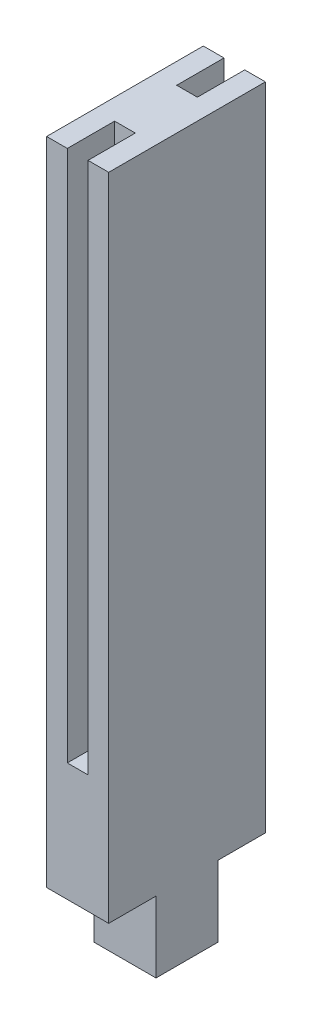
ISO-10303-21;
HEADER;
FILE_DESCRIPTION(('STEP AP214'),'2;1');
FILE_NAME('part.step','',(''),(''),'','','');
FILE_SCHEMA(('AUTOMOTIVE_DESIGN { 1 0 10303 214 1 1 1 1 }'));
ENDSEC;
DATA;
#1=APPLICATION_CONTEXT('core data for automotive mechanical design processes');
#2=APPLICATION_PROTOCOL_DEFINITION('international standard','automotive_design',2000,#1);
#3=PRODUCT_CONTEXT('',#1,'mechanical');
#4=PRODUCT('Part','Part','',(#3));
#5=PRODUCT_RELATED_PRODUCT_CATEGORY('part','',(#4));
#6=PRODUCT_DEFINITION_FORMATION('','',#4);
#7=PRODUCT_DEFINITION_CONTEXT('part definition',#1,'design');
#8=PRODUCT_DEFINITION('design','',#6,#7);
#9=PRODUCT_DEFINITION_SHAPE('','',#8);
#10=(LENGTH_UNIT() NAMED_UNIT(*) SI_UNIT(.MILLI.,.METRE.));
#11=(NAMED_UNIT(*) PLANE_ANGLE_UNIT() SI_UNIT($,.RADIAN.));
#12=(NAMED_UNIT(*) SI_UNIT($,.STERADIAN.) SOLID_ANGLE_UNIT());
#13=UNCERTAINTY_MEASURE_WITH_UNIT(LENGTH_MEASURE(1.E-05),#10,'distance_accuracy_value','');
#14=(GEOMETRIC_REPRESENTATION_CONTEXT(3) GLOBAL_UNCERTAINTY_ASSIGNED_CONTEXT((#13)) GLOBAL_UNIT_ASSIGNED_CONTEXT((#10,
#11,#12)) REPRESENTATION_CONTEXT('',''));
#15=CARTESIAN_POINT('',(0.,0.,0.));
#16=DIRECTION('',(0.,0.,1.));
#17=DIRECTION('',(1.,0.,0.));
#18=AXIS2_PLACEMENT_3D('',#15,#16,#17);
#19=CARTESIAN_POINT('',(-2.62499999999999,6.,-2.625));
#20=DIRECTION('',(0.,0.,1.));
#21=DIRECTION('',(1.,0.,0.));
#22=AXIS2_PLACEMENT_3D('',#19,#20,#21);
#23=PLANE('',#22);
#24=DIRECTION('',(-1.,0.,0.));
#25=VECTOR('',#24,1.);
#26=CARTESIAN_POINT('',(2.625,6.,-2.625));
#27=LINE('',#26,#25);
#28=CARTESIAN_POINT('',(2.62500000000001,6.,-2.625));
#29=VERTEX_POINT('',#28);
#30=CARTESIAN_POINT('',(-2.62499999999999,6.,-2.625));
#31=VERTEX_POINT('',#30);
#32=EDGE_CURVE('E57',#29,#31,#27,.T.);
#33=ORIENTED_EDGE('',*,*,#32,.F.);
#34=DIRECTION('',(0.,-1.,0.));
#35=VECTOR('',#34,1.);
#36=CARTESIAN_POINT('',(2.62500000000001,6.,-2.625));
#37=LINE('',#36,#35);
#38=CARTESIAN_POINT('',(2.62500000000001,0.,-2.625));
#39=VERTEX_POINT('',#38);
#40=EDGE_CURVE('E196',#29,#39,#37,.T.);
#41=ORIENTED_EDGE('',*,*,#40,.T.);
#42=DIRECTION('',(-1.,0.,0.));
#43=VECTOR('',#42,1.);
#44=CARTESIAN_POINT('',(-2.62499999999999,0.,-2.625));
#45=LINE('',#44,#43);
#46=CARTESIAN_POINT('',(-2.62499999999999,0.,-2.625));
#47=VERTEX_POINT('',#46);
#48=EDGE_CURVE('E262',#39,#47,#45,.T.);
#49=ORIENTED_EDGE('',*,*,#48,.T.);
#50=DIRECTION('',(0.,-1.,0.));
#51=VECTOR('',#50,1.);
#52=CARTESIAN_POINT('',(-2.62499999999999,6.,-2.625));
#53=LINE('',#52,#51);
#54=EDGE_CURVE('E276',#31,#47,#53,.T.);
#55=ORIENTED_EDGE('',*,*,#54,.F.);
#56=EDGE_LOOP('',(#33,#41,#49,#55));
#57=FACE_BOUND('',#56,.T.);
#58=ADVANCED_FACE('F35',(#57),#23,.F.);
#59=CARTESIAN_POINT('',(2.62500000000001,6.,2.625));
#60=DIRECTION('',(-1.,0.,0.));
#61=DIRECTION('',(0.,0.,1.));
#62=AXIS2_PLACEMENT_3D('',#59,#60,#61);
#63=PLANE('',#62);
#64=DIRECTION('',(0.,0.,-1.));
#65=VECTOR('',#64,1.);
#66=CARTESIAN_POINT('',(2.62500000000001,0.,2.625));
#67=LINE('',#66,#65);
#68=CARTESIAN_POINT('',(2.62500000000001,0.,2.625));
#69=VERTEX_POINT('',#68);
#70=EDGE_CURVE('E259',#69,#39,#67,.T.);
#71=ORIENTED_EDGE('',*,*,#70,.T.);
#72=ORIENTED_EDGE('',*,*,#40,.F.);
#73=DIRECTION('',(0.,0.,1.));
#74=VECTOR('',#73,1.);
#75=CARTESIAN_POINT('',(2.625,6.,-6.625));
#76=LINE('',#75,#74);
#77=CARTESIAN_POINT('',(2.625,6.,-6.625));
#78=VERTEX_POINT('',#77);
#79=EDGE_CURVE('E201',#78,#29,#76,.T.);
#80=ORIENTED_EDGE('',*,*,#79,.F.);
#81=DIRECTION('',(0.,-1.,0.));
#82=VECTOR('',#81,1.);
#83=CARTESIAN_POINT('',(2.62500000000001,61.,-6.625));
#84=LINE('',#83,#82);
#85=CARTESIAN_POINT('',(2.62500000000001,61.,-6.625));
#86=VERTEX_POINT('',#85);
#87=EDGE_CURVE('E176',#86,#78,#84,.T.);
#88=ORIENTED_EDGE('',*,*,#87,.F.);
#89=DIRECTION('',(0.,0.,-1.));
#90=VECTOR('',#89,1.);
#91=CARTESIAN_POINT('',(2.62500000000001,61.,-2.625));
#92=LINE('',#91,#90);
#93=CARTESIAN_POINT('',(2.62500000000001,61.,6.625));
#94=VERTEX_POINT('',#93);
#95=EDGE_CURVE('E239',#94,#86,#92,.T.);
#96=ORIENTED_EDGE('',*,*,#95,.F.);
#97=DIRECTION('',(0.,-1.,0.));
#98=VECTOR('',#97,1.);
#99=CARTESIAN_POINT('',(2.62500000000001,61.,6.625));
#100=LINE('',#99,#98);
#101=CARTESIAN_POINT('',(2.62500000000001,6.,6.625));
#102=VERTEX_POINT('',#101);
#103=EDGE_CURVE('E242',#94,#102,#100,.T.);
#104=ORIENTED_EDGE('',*,*,#103,.T.);
#105=DIRECTION('',(0.,0.,-1.));
#106=VECTOR('',#105,1.);
#107=CARTESIAN_POINT('',(2.62500000000001,6.,-2.625));
#108=LINE('',#107,#106);
#109=CARTESIAN_POINT('',(2.62500000000001,6.,2.625));
#110=VERTEX_POINT('',#109);
#111=EDGE_CURVE('E228',#102,#110,#108,.T.);
#112=ORIENTED_EDGE('',*,*,#111,.T.);
#113=DIRECTION('',(0.,-1.,0.));
#114=VECTOR('',#113,1.);
#115=CARTESIAN_POINT('',(2.62500000000001,6.,2.625));
#116=LINE('',#115,#114);
#117=EDGE_CURVE('E288',#110,#69,#116,.T.);
#118=ORIENTED_EDGE('',*,*,#117,.T.);
#119=EDGE_LOOP('',(#71,#72,#80,#88,#96,#104,#112,#118));
#120=FACE_BOUND('',#119,.T.);
#121=ADVANCED_FACE('F37',(#120),#63,.F.);
#122=CARTESIAN_POINT('',(-2.62499999999999,6.,2.625));
#123=DIRECTION('',(1.,0.,0.));
#124=DIRECTION('',(0.,0.,-1.));
#125=AXIS2_PLACEMENT_3D('',#122,#123,#124);
#126=PLANE('',#125);
#127=DIRECTION('',(0.,0.,1.));
#128=VECTOR('',#127,1.);
#129=CARTESIAN_POINT('',(-2.62499999999999,0.,2.625));
#130=LINE('',#129,#128);
#131=CARTESIAN_POINT('',(-2.62499999999999,0.,2.625));
#132=VERTEX_POINT('',#131);
#133=EDGE_CURVE('E266',#47,#132,#130,.T.);
#134=ORIENTED_EDGE('',*,*,#133,.T.);
#135=DIRECTION('',(0.,-1.,0.));
#136=VECTOR('',#135,1.);
#137=CARTESIAN_POINT('',(-2.62499999999999,6.,2.625));
#138=LINE('',#137,#136);
#139=CARTESIAN_POINT('',(-2.62499999999999,6.,2.625));
#140=VERTEX_POINT('',#139);
#141=EDGE_CURVE('E278',#140,#132,#138,.T.);
#142=ORIENTED_EDGE('',*,*,#141,.F.);
#143=DIRECTION('',(0.,0.,1.));
#144=VECTOR('',#143,1.);
#145=CARTESIAN_POINT('',(-2.62499999999999,6.,-2.625));
#146=LINE('',#145,#144);
#147=CARTESIAN_POINT('',(-2.62499999999999,6.,6.625));
#148=VERTEX_POINT('',#147);
#149=EDGE_CURVE('E247',#140,#148,#146,.T.);
#150=ORIENTED_EDGE('',*,*,#149,.T.);
#151=DIRECTION('',(0.,-1.,0.));
#152=VECTOR('',#151,1.);
#153=CARTESIAN_POINT('',(-2.62499999999999,61.,6.625));
#154=LINE('',#153,#152);
#155=CARTESIAN_POINT('',(-2.62499999999999,61.,6.625));
#156=VERTEX_POINT('',#155);
#157=EDGE_CURVE('E225',#156,#148,#154,.T.);
#158=ORIENTED_EDGE('',*,*,#157,.F.);
#159=DIRECTION('',(0.,0.,1.));
#160=VECTOR('',#159,1.);
#161=CARTESIAN_POINT('',(-2.62499999999999,61.,-2.625));
#162=LINE('',#161,#160);
#163=CARTESIAN_POINT('',(-2.62499999999999,61.,-6.625));
#164=VERTEX_POINT('',#163);
#165=EDGE_CURVE('E223',#164,#156,#162,.T.);
#166=ORIENTED_EDGE('',*,*,#165,.F.);
#167=DIRECTION('',(0.,1.,0.));
#168=VECTOR('',#167,1.);
#169=CARTESIAN_POINT('',(-2.62499999999999,61.,-6.625));
#170=LINE('',#169,#168);
#171=CARTESIAN_POINT('',(-2.62499999999999,6.,-6.625));
#172=VERTEX_POINT('',#171);
#173=EDGE_CURVE('E181',#172,#164,#170,.T.);
#174=ORIENTED_EDGE('',*,*,#173,.F.);
#175=DIRECTION('',(0.,0.,1.));
#176=VECTOR('',#175,1.);
#177=CARTESIAN_POINT('',(-2.62499999999999,6.,-6.625));
#178=LINE('',#177,#176);
#179=EDGE_CURVE('E188',#172,#31,#178,.T.);
#180=ORIENTED_EDGE('',*,*,#179,.T.);
#181=ORIENTED_EDGE('',*,*,#54,.T.);
#182=EDGE_LOOP('',(#134,#142,#150,#158,#166,#174,#180,#181));
#183=FACE_BOUND('',#182,.T.);
#184=ADVANCED_FACE('F221',(#183),#126,.F.);
#185=CARTESIAN_POINT('',(-2.62499999999999,6.,2.625));
#186=DIRECTION('',(0.,0.,-1.));
#187=DIRECTION('',(-1.,0.,0.));
#188=AXIS2_PLACEMENT_3D('',#185,#186,#187);
#189=PLANE('',#188);
#190=DIRECTION('',(1.,0.,0.));
#191=VECTOR('',#190,1.);
#192=CARTESIAN_POINT('',(-2.62499999999999,0.,2.625));
#193=LINE('',#192,#191);
#194=EDGE_CURVE('E270',#132,#69,#193,.T.);
#195=ORIENTED_EDGE('',*,*,#194,.T.);
#196=ORIENTED_EDGE('',*,*,#117,.F.);
#197=DIRECTION('',(1.,0.,0.));
#198=VECTOR('',#197,1.);
#199=CARTESIAN_POINT('',(-2.62499999999999,6.,2.625));
#200=LINE('',#199,#198);
#201=EDGE_CURVE('E272',#140,#110,#200,.T.);
#202=ORIENTED_EDGE('',*,*,#201,.F.);
#203=ORIENTED_EDGE('',*,*,#141,.T.);
#204=EDGE_LOOP('',(#195,#196,#202,#203));
#205=FACE_BOUND('',#204,.T.);
#206=ADVANCED_FACE('F313',(#205),#189,.F.);
#207=CARTESIAN_POINT('',(0.,0.,0.));
#208=DIRECTION('',(0.,-1.,0.));
#209=DIRECTION('',(0.,0.,-1.));
#210=AXIS2_PLACEMENT_3D('',#207,#208,#209);
#211=PLANE('',#210);
#212=ORIENTED_EDGE('',*,*,#70,.F.);
#213=ORIENTED_EDGE('',*,*,#194,.F.);
#214=ORIENTED_EDGE('',*,*,#133,.F.);
#215=ORIENTED_EDGE('',*,*,#48,.F.);
#216=EDGE_LOOP('',(#212,#213,#214,#215));
#217=FACE_BOUND('',#216,.T.);
#218=ADVANCED_FACE('F297',(#217),#211,.T.);
#219=CARTESIAN_POINT('',(0.,6.,0.));
#220=DIRECTION('',(0.,1.,0.));
#221=DIRECTION('',(0.,0.,1.));
#222=AXIS2_PLACEMENT_3D('',#219,#220,#221);
#223=PLANE('',#222);
#224=ORIENTED_EDGE('',*,*,#149,.F.);
#225=ORIENTED_EDGE('',*,*,#201,.T.);
#226=ORIENTED_EDGE('',*,*,#111,.F.);
#227=DIRECTION('',(1.,0.,0.));
#228=VECTOR('',#227,1.);
#229=CARTESIAN_POINT('',(-2.62499999999999,6.,6.625));
#230=LINE('',#229,#228);
#231=EDGE_CURVE('E233',#148,#102,#230,.T.);
#232=ORIENTED_EDGE('',*,*,#231,.F.);
#233=EDGE_LOOP('',(#224,#225,#226,#232));
#234=FACE_BOUND('',#233,.T.);
#235=ADVANCED_FACE('F312',(#234),#223,.F.);
#236=CARTESIAN_POINT('',(-2.62499999999999,61.,6.625));
#237=DIRECTION('',(0.,0.,-1.));
#238=DIRECTION('',(-1.,0.,0.));
#239=AXIS2_PLACEMENT_3D('',#236,#237,#238);
#240=PLANE('',#239);
#241=DIRECTION('',(1.,0.,0.));
#242=VECTOR('',#241,1.);
#243=CARTESIAN_POINT('',(-2.62499999999999,61.,6.625));
#244=LINE('',#243,#242);
#245=CARTESIAN_POINT('',(0.875,61.,6.625));
#246=VERTEX_POINT('',#245);
#247=EDGE_CURVE('E227',#246,#94,#244,.T.);
#248=ORIENTED_EDGE('',*,*,#247,.F.);
#249=DIRECTION('',(0.,-1.,0.));
#250=VECTOR('',#249,1.);
#251=CARTESIAN_POINT('',(0.875,61.,6.625));
#252=LINE('',#251,#250);
#253=CARTESIAN_POINT('',(0.875,16.,6.625));
#254=VERTEX_POINT('',#253);
#255=EDGE_CURVE('E236',#246,#254,#252,.T.);
#256=ORIENTED_EDGE('',*,*,#255,.T.);
#257=DIRECTION('',(-1.,0.,0.));
#258=VECTOR('',#257,1.);
#259=CARTESIAN_POINT('',(-2.62499999999999,16.,6.625));
#260=LINE('',#259,#258);
#261=CARTESIAN_POINT('',(-0.875,16.,6.625));
#262=VERTEX_POINT('',#261);
#263=EDGE_CURVE('E209',#254,#262,#260,.T.);
#264=ORIENTED_EDGE('',*,*,#263,.T.);
#265=DIRECTION('',(0.,1.,0.));
#266=VECTOR('',#265,1.);
#267=CARTESIAN_POINT('',(-0.875,61.,6.625));
#268=LINE('',#267,#266);
#269=CARTESIAN_POINT('',(-0.875,61.,6.625));
#270=VERTEX_POINT('',#269);
#271=EDGE_CURVE('E501',#262,#270,#268,.T.);
#272=ORIENTED_EDGE('',*,*,#271,.T.);
#273=EDGE_CURVE('E230',#156,#270,#244,.T.);
#274=ORIENTED_EDGE('',*,*,#273,.F.);
#275=ORIENTED_EDGE('',*,*,#157,.T.);
#276=ORIENTED_EDGE('',*,*,#231,.T.);
#277=ORIENTED_EDGE('',*,*,#103,.F.);
#278=EDGE_LOOP('',(#248,#256,#264,#272,#274,#275,#276,#277));
#279=FACE_BOUND('',#278,.T.);
#280=ADVANCED_FACE('F308',(#279),#240,.F.);
#281=CARTESIAN_POINT('',(0.,61.,0.));
#282=DIRECTION('',(0.,1.,0.));
#283=DIRECTION('',(0.,0.,1.));
#284=AXIS2_PLACEMENT_3D('',#281,#282,#283);
#285=PLANE('',#284);
#286=DIRECTION('',(0.,0.,-1.));
#287=VECTOR('',#286,1.);
#288=CARTESIAN_POINT('',(0.875,61.,-10.625));
#289=LINE('',#288,#287);
#290=CARTESIAN_POINT('',(0.875,61.,-2.625));
#291=VERTEX_POINT('',#290);
#292=CARTESIAN_POINT('',(0.875,61.,-6.625));
#293=VERTEX_POINT('',#292);
#294=EDGE_CURVE('E170',#291,#293,#289,.T.);
#295=ORIENTED_EDGE('',*,*,#294,.F.);
#296=DIRECTION('',(1.,0.,0.));
#297=VECTOR('',#296,1.);
#298=CARTESIAN_POINT('',(-0.875,61.,-2.625));
#299=LINE('',#298,#297);
#300=CARTESIAN_POINT('',(-0.875,61.,-2.625));
#301=VERTEX_POINT('',#300);
#302=EDGE_CURVE('E173',#301,#291,#299,.T.);
#303=ORIENTED_EDGE('',*,*,#302,.F.);
#304=DIRECTION('',(0.,0.,1.));
#305=VECTOR('',#304,1.);
#306=CARTESIAN_POINT('',(-0.874999999999999,61.,-10.625));
#307=LINE('',#306,#305);
#308=CARTESIAN_POINT('',(-0.874999999999999,61.,-6.625));
#309=VERTEX_POINT('',#308);
#310=EDGE_CURVE('E160',#309,#301,#307,.T.);
#311=ORIENTED_EDGE('',*,*,#310,.F.);
#312=DIRECTION('',(1.,0.,0.));
#313=VECTOR('',#312,1.);
#314=CARTESIAN_POINT('',(2.62500000000001,61.,-6.625));
#315=LINE('',#314,#313);
#316=EDGE_CURVE('E185',#164,#309,#315,.T.);
#317=ORIENTED_EDGE('',*,*,#316,.F.);
#318=ORIENTED_EDGE('',*,*,#165,.T.);
#319=ORIENTED_EDGE('',*,*,#273,.T.);
#320=DIRECTION('',(0.,0.,1.));
#321=VECTOR('',#320,1.);
#322=CARTESIAN_POINT('',(-0.875,61.,10.625));
#323=LINE('',#322,#321);
#324=CARTESIAN_POINT('',(-0.875,61.,2.625));
#325=VERTEX_POINT('',#324);
#326=EDGE_CURVE('E490',#325,#270,#323,.T.);
#327=ORIENTED_EDGE('',*,*,#326,.F.);
#328=DIRECTION('',(-1.,0.,0.));
#329=VECTOR('',#328,1.);
#330=CARTESIAN_POINT('',(-0.875,61.,2.625));
#331=LINE('',#330,#329);
#332=CARTESIAN_POINT('',(0.875,61.,2.625));
#333=VERTEX_POINT('',#332);
#334=EDGE_CURVE('E206',#333,#325,#331,.T.);
#335=ORIENTED_EDGE('',*,*,#334,.F.);
#336=DIRECTION('',(0.,0.,-1.));
#337=VECTOR('',#336,1.);
#338=CARTESIAN_POINT('',(0.875000000000001,61.,0.));
#339=LINE('',#338,#337);
#340=EDGE_CURVE('E281',#246,#333,#339,.T.);
#341=ORIENTED_EDGE('',*,*,#340,.F.);
#342=ORIENTED_EDGE('',*,*,#247,.T.);
#343=ORIENTED_EDGE('',*,*,#95,.T.);
#344=EDGE_CURVE('E184',#293,#86,#315,.T.);
#345=ORIENTED_EDGE('',*,*,#344,.F.);
#346=EDGE_LOOP('',(#295,#303,#311,#317,#318,#319,#327,#335,#341,#342,#343,#345));
#347=FACE_BOUND('',#346,.T.);
#348=ADVANCED_FACE('F214',(#347),#285,.T.);
#349=CARTESIAN_POINT('',(0.,16.,0.));
#350=DIRECTION('',(0.,-1.,0.));
#351=DIRECTION('',(0.,0.,-1.));
#352=AXIS2_PLACEMENT_3D('',#349,#350,#351);
#353=PLANE('',#352);
#354=DIRECTION('',(0.,0.,-1.));
#355=VECTOR('',#354,1.);
#356=CARTESIAN_POINT('',(0.875,16.,10.625));
#357=LINE('',#356,#355);
#358=CARTESIAN_POINT('',(0.875,16.,2.625));
#359=VERTEX_POINT('',#358);
#360=EDGE_CURVE('E191',#254,#359,#357,.T.);
#361=ORIENTED_EDGE('',*,*,#360,.T.);
#362=DIRECTION('',(-1.,0.,0.));
#363=VECTOR('',#362,1.);
#364=CARTESIAN_POINT('',(-0.875,16.,2.625));
#365=LINE('',#364,#363);
#366=CARTESIAN_POINT('',(-0.875,16.,2.625));
#367=VERTEX_POINT('',#366);
#368=EDGE_CURVE('E489',#359,#367,#365,.T.);
#369=ORIENTED_EDGE('',*,*,#368,.T.);
#370=DIRECTION('',(0.,0.,1.));
#371=VECTOR('',#370,1.);
#372=CARTESIAN_POINT('',(-0.875,16.,10.625));
#373=LINE('',#372,#371);
#374=EDGE_CURVE('E494',#367,#262,#373,.T.);
#375=ORIENTED_EDGE('',*,*,#374,.T.);
#376=ORIENTED_EDGE('',*,*,#263,.F.);
#377=EDGE_LOOP('',(#361,#369,#375,#376));
#378=FACE_BOUND('',#377,.T.);
#379=ADVANCED_FACE('F344',(#378),#353,.F.);
#380=CARTESIAN_POINT('',(0.875,16.,10.625));
#381=DIRECTION('',(1.,0.,0.));
#382=DIRECTION('',(0.,0.,-1.));
#383=AXIS2_PLACEMENT_3D('',#380,#381,#382);
#384=PLANE('',#383);
#385=ORIENTED_EDGE('',*,*,#340,.T.);
#386=DIRECTION('',(0.,1.,0.));
#387=VECTOR('',#386,1.);
#388=CARTESIAN_POINT('',(0.875,16.,2.625));
#389=LINE('',#388,#387);
#390=EDGE_CURVE('E491',#359,#333,#389,.T.);
#391=ORIENTED_EDGE('',*,*,#390,.F.);
#392=ORIENTED_EDGE('',*,*,#360,.F.);
#393=ORIENTED_EDGE('',*,*,#255,.F.);
#394=EDGE_LOOP('',(#385,#391,#392,#393));
#395=FACE_BOUND('',#394,.T.);
#396=ADVANCED_FACE('F435',(#395),#384,.F.);
#397=CARTESIAN_POINT('',(-0.875,16.,10.625));
#398=DIRECTION('',(-1.,0.,0.));
#399=DIRECTION('',(0.,0.,1.));
#400=AXIS2_PLACEMENT_3D('',#397,#398,#399);
#401=PLANE('',#400);
#402=ORIENTED_EDGE('',*,*,#374,.F.);
#403=DIRECTION('',(0.,1.,0.));
#404=VECTOR('',#403,1.);
#405=CARTESIAN_POINT('',(-0.875,16.,2.625));
#406=LINE('',#405,#404);
#407=EDGE_CURVE('E493',#367,#325,#406,.T.);
#408=ORIENTED_EDGE('',*,*,#407,.T.);
#409=ORIENTED_EDGE('',*,*,#326,.T.);
#410=ORIENTED_EDGE('',*,*,#271,.F.);
#411=EDGE_LOOP('',(#402,#408,#409,#410));
#412=FACE_BOUND('',#411,.T.);
#413=ADVANCED_FACE('F426',(#412),#401,.F.);
#414=CARTESIAN_POINT('',(-0.875,16.,2.625));
#415=DIRECTION('',(0.,0.,-1.));
#416=DIRECTION('',(-1.,0.,0.));
#417=AXIS2_PLACEMENT_3D('',#414,#415,#416);
#418=PLANE('',#417);
#419=ORIENTED_EDGE('',*,*,#334,.T.);
#420=ORIENTED_EDGE('',*,*,#407,.F.);
#421=ORIENTED_EDGE('',*,*,#368,.F.);
#422=ORIENTED_EDGE('',*,*,#390,.T.);
#423=EDGE_LOOP('',(#419,#420,#421,#422));
#424=FACE_BOUND('',#423,.T.);
#425=ADVANCED_FACE('F351',(#424),#418,.F.);
#426=CARTESIAN_POINT('',(2.625,6.,-6.625));
#427=DIRECTION('',(0.,1.,0.));
#428=DIRECTION('',(0.,0.,1.));
#429=AXIS2_PLACEMENT_3D('',#426,#427,#428);
#430=PLANE('',#429);
#431=ORIENTED_EDGE('',*,*,#32,.T.);
#432=ORIENTED_EDGE('',*,*,#179,.F.);
#433=DIRECTION('',(-1.,0.,0.));
#434=VECTOR('',#433,1.);
#435=CARTESIAN_POINT('',(2.625,6.,-6.625));
#436=LINE('',#435,#434);
#437=EDGE_CURVE('E179',#78,#172,#436,.T.);
#438=ORIENTED_EDGE('',*,*,#437,.F.);
#439=ORIENTED_EDGE('',*,*,#79,.T.);
#440=EDGE_LOOP('',(#431,#432,#438,#439));
#441=FACE_BOUND('',#440,.T.);
#442=ADVANCED_FACE('F302',(#441),#430,.F.);
#443=CARTESIAN_POINT('',(0.,0.,-6.625));
#444=DIRECTION('',(0.,0.,-1.));
#445=DIRECTION('',(-1.,0.,0.));
#446=AXIS2_PLACEMENT_3D('',#443,#444,#445);
#447=PLANE('',#446);
#448=DIRECTION('',(0.,-1.,0.));
#449=VECTOR('',#448,1.);
#450=CARTESIAN_POINT('',(0.875,0.,-6.625));
#451=LINE('',#450,#449);
#452=CARTESIAN_POINT('',(0.875,16.,-6.625));
#453=VERTEX_POINT('',#452);
#454=EDGE_CURVE('E11',#293,#453,#451,.T.);
#455=ORIENTED_EDGE('',*,*,#454,.F.);
#456=ORIENTED_EDGE('',*,*,#344,.T.);
#457=ORIENTED_EDGE('',*,*,#87,.T.);
#458=ORIENTED_EDGE('',*,*,#437,.T.);
#459=ORIENTED_EDGE('',*,*,#173,.T.);
#460=ORIENTED_EDGE('',*,*,#316,.T.);
#461=DIRECTION('',(0.,1.,0.));
#462=VECTOR('',#461,1.);
#463=CARTESIAN_POINT('',(-0.874999999999999,0.,-6.625));
#464=LINE('',#463,#462);
#465=CARTESIAN_POINT('',(-0.874999999999999,16.,-6.625));
#466=VERTEX_POINT('',#465);
#467=EDGE_CURVE('E43',#466,#309,#464,.T.);
#468=ORIENTED_EDGE('',*,*,#467,.F.);
#469=DIRECTION('',(1.,0.,0.));
#470=VECTOR('',#469,1.);
#471=CARTESIAN_POINT('',(0.,16.,-6.625));
#472=LINE('',#471,#470);
#473=EDGE_CURVE('E152',#466,#453,#472,.T.);
#474=ORIENTED_EDGE('',*,*,#473,.T.);
#475=EDGE_LOOP('',(#455,#456,#457,#458,#459,#460,#468,#474));
#476=FACE_BOUND('',#475,.T.);
#477=ADVANCED_FACE('F217',(#476),#447,.T.);
#478=CARTESIAN_POINT('',(0.875,16.,-10.625));
#479=DIRECTION('',(1.,0.,0.));
#480=DIRECTION('',(0.,0.,-1.));
#481=AXIS2_PLACEMENT_3D('',#478,#479,#480);
#482=PLANE('',#481);
#483=ORIENTED_EDGE('',*,*,#454,.T.);
#484=DIRECTION('',(0.,0.,-1.));
#485=VECTOR('',#484,1.);
#486=CARTESIAN_POINT('',(0.875,16.,-10.625));
#487=LINE('',#486,#485);
#488=CARTESIAN_POINT('',(0.875,16.,-2.625));
#489=VERTEX_POINT('',#488);
#490=EDGE_CURVE('E50',#489,#453,#487,.T.);
#491=ORIENTED_EDGE('',*,*,#490,.F.);
#492=DIRECTION('',(0.,1.,0.));
#493=VECTOR('',#492,1.);
#494=CARTESIAN_POINT('',(0.875,16.,-2.625));
#495=LINE('',#494,#493);
#496=EDGE_CURVE('E164',#489,#291,#495,.T.);
#497=ORIENTED_EDGE('',*,*,#496,.T.);
#498=ORIENTED_EDGE('',*,*,#294,.T.);
#499=EDGE_LOOP('',(#483,#491,#497,#498));
#500=FACE_BOUND('',#499,.T.);
#501=ADVANCED_FACE('F357',(#500),#482,.F.);
#502=CARTESIAN_POINT('',(-0.875,16.,-2.625));
#503=DIRECTION('',(0.,0.,1.));
#504=DIRECTION('',(1.,0.,0.));
#505=AXIS2_PLACEMENT_3D('',#502,#503,#504);
#506=PLANE('',#505);
#507=ORIENTED_EDGE('',*,*,#302,.T.);
#508=ORIENTED_EDGE('',*,*,#496,.F.);
#509=DIRECTION('',(1.,0.,0.));
#510=VECTOR('',#509,1.);
#511=CARTESIAN_POINT('',(-0.875,16.,-2.625));
#512=LINE('',#511,#510);
#513=CARTESIAN_POINT('',(-0.875,16.,-2.625));
#514=VERTEX_POINT('',#513);
#515=EDGE_CURVE('E150',#514,#489,#512,.T.);
#516=ORIENTED_EDGE('',*,*,#515,.F.);
#517=DIRECTION('',(0.,1.,0.));
#518=VECTOR('',#517,1.);
#519=CARTESIAN_POINT('',(-0.875,16.,-2.625));
#520=LINE('',#519,#518);
#521=EDGE_CURVE('E157',#514,#301,#520,.T.);
#522=ORIENTED_EDGE('',*,*,#521,.T.);
#523=EDGE_LOOP('',(#507,#508,#516,#522));
#524=FACE_BOUND('',#523,.T.);
#525=ADVANCED_FACE('F166',(#524),#506,.F.);
#526=CARTESIAN_POINT('',(-0.874999999999999,16.,-10.625));
#527=DIRECTION('',(-1.,0.,0.));
#528=DIRECTION('',(0.,0.,1.));
#529=AXIS2_PLACEMENT_3D('',#526,#527,#528);
#530=PLANE('',#529);
#531=ORIENTED_EDGE('',*,*,#467,.T.);
#532=ORIENTED_EDGE('',*,*,#310,.T.);
#533=ORIENTED_EDGE('',*,*,#521,.F.);
#534=DIRECTION('',(0.,0.,1.));
#535=VECTOR('',#534,1.);
#536=CARTESIAN_POINT('',(-0.874999999999999,16.,-10.625));
#537=LINE('',#536,#535);
#538=EDGE_CURVE('E146',#466,#514,#537,.T.);
#539=ORIENTED_EDGE('',*,*,#538,.F.);
#540=EDGE_LOOP('',(#531,#532,#533,#539));
#541=FACE_BOUND('',#540,.T.);
#542=ADVANCED_FACE('F158',(#541),#530,.F.);
#543=CARTESIAN_POINT('',(0.,16.,0.));
#544=DIRECTION('',(0.,1.,0.));
#545=DIRECTION('',(0.,0.,1.));
#546=AXIS2_PLACEMENT_3D('',#543,#544,#545);
#547=PLANE('',#546);
#548=ORIENTED_EDGE('',*,*,#538,.T.);
#549=ORIENTED_EDGE('',*,*,#515,.T.);
#550=ORIENTED_EDGE('',*,*,#490,.T.);
#551=ORIENTED_EDGE('',*,*,#473,.F.);
#552=EDGE_LOOP('',(#548,#549,#550,#551));
#553=FACE_BOUND('',#552,.T.);
#554=ADVANCED_FACE('F148',(#553),#547,.T.);
#555=CLOSED_SHELL('',(#58,#121,#184,#206,#218,#235,#280,#348,#379,#396,#413,#425,#442,#477,#501,
#525,#542,#554));
#556=MANIFOLD_SOLID_BREP('B2',#555);
#557=ADVANCED_BREP_SHAPE_REPRESENTATION('',(#18,#556),#14);
#558=SHAPE_DEFINITION_REPRESENTATION(#9,#557);
ENDSEC;
END-ISO-10303-21;
